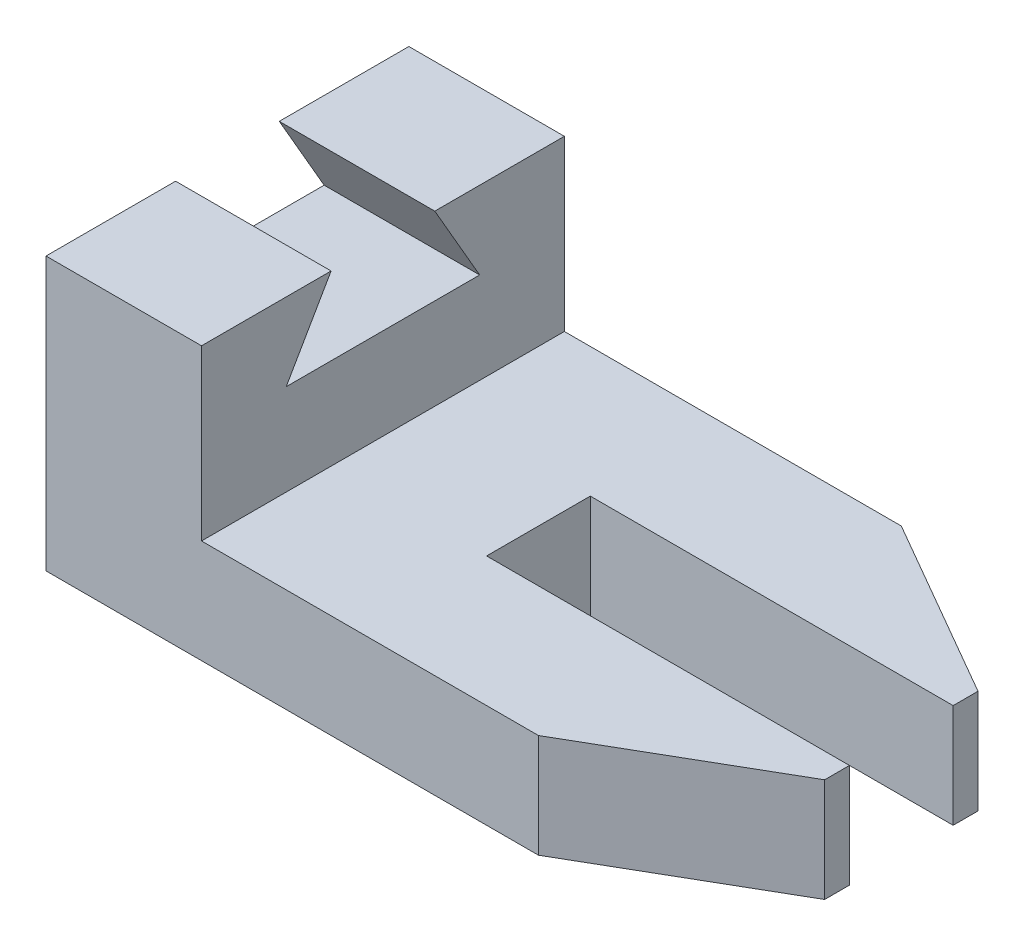
ISO-10303-21;
HEADER;
FILE_DESCRIPTION(('STEP AP214'),'2;1');
FILE_NAME('part.step','',(''),(''),'','','');
FILE_SCHEMA(('AUTOMOTIVE_DESIGN { 1 0 10303 214 1 1 1 1 }'));
ENDSEC;
DATA;
#1=APPLICATION_CONTEXT('core data for automotive mechanical design processes');
#2=APPLICATION_PROTOCOL_DEFINITION('international standard','automotive_design',2000,#1);
#3=PRODUCT_CONTEXT('',#1,'mechanical');
#4=PRODUCT('Part','Part','',(#3));
#5=PRODUCT_RELATED_PRODUCT_CATEGORY('part','',(#4));
#6=PRODUCT_DEFINITION_FORMATION('','',#4);
#7=PRODUCT_DEFINITION_CONTEXT('part definition',#1,'design');
#8=PRODUCT_DEFINITION('design','',#6,#7);
#9=PRODUCT_DEFINITION_SHAPE('','',#8);
#10=(LENGTH_UNIT() NAMED_UNIT(*) SI_UNIT(.MILLI.,.METRE.));
#11=(NAMED_UNIT(*) PLANE_ANGLE_UNIT() SI_UNIT($,.RADIAN.));
#12=(NAMED_UNIT(*) SI_UNIT($,.STERADIAN.) SOLID_ANGLE_UNIT());
#13=UNCERTAINTY_MEASURE_WITH_UNIT(LENGTH_MEASURE(1.E-05),#10,'distance_accuracy_value','');
#14=(GEOMETRIC_REPRESENTATION_CONTEXT(3) GLOBAL_UNCERTAINTY_ASSIGNED_CONTEXT((#13)) GLOBAL_UNIT_ASSIGNED_CONTEXT((#10,
#11,#12)) REPRESENTATION_CONTEXT('',''));
#15=CARTESIAN_POINT('',(0.,0.,0.));
#16=DIRECTION('',(0.,0.,1.));
#17=DIRECTION('',(1.,0.,0.));
#18=AXIS2_PLACEMENT_3D('',#15,#16,#17);
#19=CARTESIAN_POINT('',(0.,20.,0.));
#20=DIRECTION('',(0.,-1.,0.));
#21=DIRECTION('',(0.,0.,-1.));
#22=AXIS2_PLACEMENT_3D('',#19,#20,#21);
#23=PLANE('',#22);
#24=DIRECTION('',(-1.,0.,0.));
#25=VECTOR('',#24,1.);
#26=CARTESIAN_POINT('',(0.,20.,-70.));
#27=LINE('',#26,#25);
#28=CARTESIAN_POINT('',(95.,20.,-70.));
#29=VERTEX_POINT('',#28);
#30=CARTESIAN_POINT('',(30.,20.,-70.));
#31=VERTEX_POINT('',#30);
#32=EDGE_CURVE('E224',#29,#31,#27,.T.);
#33=ORIENTED_EDGE('',*,*,#32,.T.);
#34=DIRECTION('',(0.,0.,1.));
#35=VECTOR('',#34,1.);
#36=CARTESIAN_POINT('',(30.,20.,-35.));
#37=LINE('',#36,#35);
#38=CARTESIAN_POINT('',(30.,20.,0.));
#39=VERTEX_POINT('',#38);
#40=EDGE_CURVE('E50',#31,#39,#37,.T.);
#41=ORIENTED_EDGE('',*,*,#40,.T.);
#42=DIRECTION('',(1.,0.,0.));
#43=VECTOR('',#42,1.);
#44=CARTESIAN_POINT('',(0.,20.,0.));
#45=LINE('',#44,#43);
#46=CARTESIAN_POINT('',(95.,20.,0.));
#47=VERTEX_POINT('',#46);
#48=EDGE_CURVE('E188',#39,#47,#45,.T.);
#49=ORIENTED_EDGE('',*,*,#48,.T.);
#50=DIRECTION('',(0.866025403784438,0.,-0.500000000000001));
#51=VECTOR('',#50,1.);
#52=CARTESIAN_POINT('',(95.,20.,0.));
#53=LINE('',#52,#51);
#54=CARTESIAN_POINT('',(130.,20.,-20.207259421637));
#55=VERTEX_POINT('',#54);
#56=EDGE_CURVE('E210',#47,#55,#53,.T.);
#57=ORIENTED_EDGE('',*,*,#56,.T.);
#58=DIRECTION('',(0.,0.,-1.));
#59=VECTOR('',#58,1.);
#60=CARTESIAN_POINT('',(130.,20.,-20.207259421637));
#61=LINE('',#60,#59);
#62=CARTESIAN_POINT('',(130.,20.,-24.997259421637));
#63=VERTEX_POINT('',#62);
#64=EDGE_CURVE('E212',#55,#63,#61,.T.);
#65=ORIENTED_EDGE('',*,*,#64,.T.);
#66=DIRECTION('',(-1.,0.,0.));
#67=VECTOR('',#66,1.);
#68=CARTESIAN_POINT('',(130.,20.,-24.997259421637));
#69=LINE('',#68,#67);
#70=CARTESIAN_POINT('',(60.,20.,-24.997259421637));
#71=VERTEX_POINT('',#70);
#72=EDGE_CURVE('E214',#63,#71,#69,.T.);
#73=ORIENTED_EDGE('',*,*,#72,.T.);
#74=DIRECTION('',(0.,0.,-1.));
#75=VECTOR('',#74,1.);
#76=CARTESIAN_POINT('',(60.,20.,-24.997259421637));
#77=LINE('',#76,#75);
#78=CARTESIAN_POINT('',(60.,20.,-44.997259421637));
#79=VERTEX_POINT('',#78);
#80=EDGE_CURVE('E216',#71,#79,#77,.T.);
#81=ORIENTED_EDGE('',*,*,#80,.T.);
#82=DIRECTION('',(1.,0.,0.));
#83=VECTOR('',#82,1.);
#84=CARTESIAN_POINT('',(60.,20.,-44.997259421637));
#85=LINE('',#84,#83);
#86=CARTESIAN_POINT('',(130.,20.,-44.997259421637));
#87=VERTEX_POINT('',#86);
#88=EDGE_CURVE('E218',#79,#87,#85,.T.);
#89=ORIENTED_EDGE('',*,*,#88,.T.);
#90=DIRECTION('',(0.,0.,-1.));
#91=VECTOR('',#90,1.);
#92=CARTESIAN_POINT('',(130.,20.,-44.997259421637));
#93=LINE('',#92,#91);
#94=CARTESIAN_POINT('',(130.,20.,-49.792740578363));
#95=VERTEX_POINT('',#94);
#96=EDGE_CURVE('E220',#87,#95,#93,.T.);
#97=ORIENTED_EDGE('',*,*,#96,.T.);
#98=DIRECTION('',(-0.866025403784438,0.,-0.500000000000001));
#99=VECTOR('',#98,1.);
#100=CARTESIAN_POINT('',(95.,20.,-70.));
#101=LINE('',#100,#99);
#102=EDGE_CURVE('E222',#95,#29,#101,.T.);
#103=ORIENTED_EDGE('',*,*,#102,.T.);
#104=EDGE_LOOP('',(#33,#41,#49,#57,#65,#73,#81,#89,#97,#103));
#105=FACE_BOUND('',#104,.T.);
#106=ADVANCED_FACE('F33',(#105),#23,.F.);
#107=CARTESIAN_POINT('',(0.,20.,0.));
#108=DIRECTION('',(1.,0.,0.));
#109=DIRECTION('',(0.,0.,-1.));
#110=AXIS2_PLACEMENT_3D('',#107,#108,#109);
#111=PLANE('',#110);
#112=DIRECTION('',(0.,0.,1.));
#113=VECTOR('',#112,1.);
#114=CARTESIAN_POINT('',(0.,0.,0.));
#115=LINE('',#114,#113);
#116=CARTESIAN_POINT('',(0.,0.,-70.));
#117=VERTEX_POINT('',#116);
#118=CARTESIAN_POINT('',(0.,0.,0.));
#119=VERTEX_POINT('',#118);
#120=EDGE_CURVE('E205',#117,#119,#115,.T.);
#121=ORIENTED_EDGE('',*,*,#120,.T.);
#122=DIRECTION('',(0.,-1.,0.));
#123=VECTOR('',#122,1.);
#124=CARTESIAN_POINT('',(0.,20.,0.));
#125=LINE('',#124,#123);
#126=CARTESIAN_POINT('',(0.,52.6091602691578,0.));
#127=VERTEX_POINT('',#126);
#128=EDGE_CURVE('E11',#127,#119,#125,.T.);
#129=ORIENTED_EDGE('',*,*,#128,.F.);
#130=DIRECTION('',(0.,0.,-1.));
#131=VECTOR('',#130,1.);
#132=CARTESIAN_POINT('',(0.,52.6091602691578,0.));
#133=LINE('',#132,#131);
#134=CARTESIAN_POINT('',(0.,52.6091602691574,-25.0000000000007));
#135=VERTEX_POINT('',#134);
#136=EDGE_CURVE('E197',#127,#135,#133,.T.);
#137=ORIENTED_EDGE('',*,*,#136,.T.);
#138=DIRECTION('',(0.,-0.866025403784436,0.500000000000004));
#139=VECTOR('',#138,1.);
#140=CARTESIAN_POINT('',(0.,52.6091602691574,-25.0000000000007));
#141=LINE('',#140,#139);
#142=CARTESIAN_POINT('',(0.,37.6091602691574,-16.3397459621562));
#143=VERTEX_POINT('',#142);
#144=EDGE_CURVE('E200',#135,#143,#141,.T.);
#145=ORIENTED_EDGE('',*,*,#144,.T.);
#146=DIRECTION('',(0.,0.,-1.));
#147=VECTOR('',#146,1.);
#148=CARTESIAN_POINT('',(0.,37.6091602691574,-16.3397459621562));
#149=LINE('',#148,#147);
#150=CARTESIAN_POINT('',(0.,37.6091602691574,-53.6602540378438));
#151=VERTEX_POINT('',#150);
#152=EDGE_CURVE('E187',#143,#151,#149,.T.);
#153=ORIENTED_EDGE('',*,*,#152,.T.);
#154=DIRECTION('',(0.,-0.866025403784436,-0.500000000000004));
#155=VECTOR('',#154,1.);
#156=CARTESIAN_POINT('',(0.,52.6091602691574,-44.9999999999993));
#157=LINE('',#156,#155);
#158=CARTESIAN_POINT('',(0.,52.6091602691574,-44.9999999999993));
#159=VERTEX_POINT('',#158);
#160=EDGE_CURVE('E172',#159,#151,#157,.T.);
#161=ORIENTED_EDGE('',*,*,#160,.F.);
#162=DIRECTION('',(0.,0.,1.));
#163=VECTOR('',#162,1.);
#164=CARTESIAN_POINT('',(0.,52.6091602691578,-70.));
#165=LINE('',#164,#163);
#166=CARTESIAN_POINT('',(0.,52.6091602691578,-70.));
#167=VERTEX_POINT('',#166);
#168=EDGE_CURVE('E167',#167,#159,#165,.T.);
#169=ORIENTED_EDGE('',*,*,#168,.F.);
#170=DIRECTION('',(0.,-1.,0.));
#171=VECTOR('',#170,1.);
#172=CARTESIAN_POINT('',(0.,20.,-70.));
#173=LINE('',#172,#171);
#174=EDGE_CURVE('E226',#167,#117,#173,.T.);
#175=ORIENTED_EDGE('',*,*,#174,.T.);
#176=EDGE_LOOP('',(#121,#129,#137,#145,#153,#161,#169,#175));
#177=FACE_BOUND('',#176,.T.);
#178=ADVANCED_FACE('F35',(#177),#111,.F.);
#179=CARTESIAN_POINT('',(0.,20.,0.));
#180=DIRECTION('',(0.,0.,-1.));
#181=DIRECTION('',(-1.,0.,0.));
#182=AXIS2_PLACEMENT_3D('',#179,#180,#181);
#183=PLANE('',#182);
#184=DIRECTION('',(1.,0.,0.));
#185=VECTOR('',#184,1.);
#186=CARTESIAN_POINT('',(0.,0.,0.));
#187=LINE('',#186,#185);
#188=CARTESIAN_POINT('',(95.,0.,0.));
#189=VERTEX_POINT('',#188);
#190=EDGE_CURVE('E229',#119,#189,#187,.T.);
#191=ORIENTED_EDGE('',*,*,#190,.T.);
#192=DIRECTION('',(0.,-1.,0.));
#193=VECTOR('',#192,1.);
#194=CARTESIAN_POINT('',(95.,20.,0.));
#195=LINE('',#194,#193);
#196=EDGE_CURVE('E42',#47,#189,#195,.T.);
#197=ORIENTED_EDGE('',*,*,#196,.F.);
#198=ORIENTED_EDGE('',*,*,#48,.F.);
#199=DIRECTION('',(0.,1.,0.));
#200=VECTOR('',#199,1.);
#201=CARTESIAN_POINT('',(30.,20.,0.));
#202=LINE('',#201,#200);
#203=CARTESIAN_POINT('',(30.,52.6091602691578,0.));
#204=VERTEX_POINT('',#203);
#205=EDGE_CURVE('E55',#39,#204,#202,.T.);
#206=ORIENTED_EDGE('',*,*,#205,.T.);
#207=DIRECTION('',(-1.,0.,0.));
#208=VECTOR('',#207,1.);
#209=CARTESIAN_POINT('',(30.,52.6091602691578,0.));
#210=LINE('',#209,#208);
#211=EDGE_CURVE('E156',#204,#127,#210,.T.);
#212=ORIENTED_EDGE('',*,*,#211,.T.);
#213=ORIENTED_EDGE('',*,*,#128,.T.);
#214=EDGE_LOOP('',(#191,#197,#198,#206,#212,#213));
#215=FACE_BOUND('',#214,.T.);
#216=ADVANCED_FACE('F294',(#215),#183,.F.);
#217=CARTESIAN_POINT('',(95.,20.,0.));
#218=DIRECTION('',(-0.500000000000001,0.,-0.866025403784438));
#219=DIRECTION('',(-0.866025403784438,0.,0.500000000000001));
#220=AXIS2_PLACEMENT_3D('',#217,#218,#219);
#221=PLANE('',#220);
#222=DIRECTION('',(0.866025403784438,0.,-0.500000000000001));
#223=VECTOR('',#222,1.);
#224=CARTESIAN_POINT('',(95.,0.,0.));
#225=LINE('',#224,#223);
#226=CARTESIAN_POINT('',(130.,0.,-20.207259421637));
#227=VERTEX_POINT('',#226);
#228=EDGE_CURVE('E231',#189,#227,#225,.T.);
#229=ORIENTED_EDGE('',*,*,#228,.T.);
#230=DIRECTION('',(0.,-1.,0.));
#231=VECTOR('',#230,1.);
#232=CARTESIAN_POINT('',(130.,20.,-20.207259421637));
#233=LINE('',#232,#231);
#234=EDGE_CURVE('E267',#55,#227,#233,.T.);
#235=ORIENTED_EDGE('',*,*,#234,.F.);
#236=ORIENTED_EDGE('',*,*,#56,.F.);
#237=ORIENTED_EDGE('',*,*,#196,.T.);
#238=EDGE_LOOP('',(#229,#235,#236,#237));
#239=FACE_BOUND('',#238,.T.);
#240=ADVANCED_FACE('F275',(#239),#221,.F.);
#241=CARTESIAN_POINT('',(130.,20.,-20.207259421637));
#242=DIRECTION('',(-1.,0.,0.));
#243=DIRECTION('',(0.,0.,1.));
#244=AXIS2_PLACEMENT_3D('',#241,#242,#243);
#245=PLANE('',#244);
#246=DIRECTION('',(0.,0.,-1.));
#247=VECTOR('',#246,1.);
#248=CARTESIAN_POINT('',(130.,0.,-20.207259421637));
#249=LINE('',#248,#247);
#250=CARTESIAN_POINT('',(130.,0.,-24.997259421637));
#251=VERTEX_POINT('',#250);
#252=EDGE_CURVE('E233',#227,#251,#249,.T.);
#253=ORIENTED_EDGE('',*,*,#252,.T.);
#254=DIRECTION('',(0.,-1.,0.));
#255=VECTOR('',#254,1.);
#256=CARTESIAN_POINT('',(130.,20.,-24.997259421637));
#257=LINE('',#256,#255);
#258=EDGE_CURVE('E264',#63,#251,#257,.T.);
#259=ORIENTED_EDGE('',*,*,#258,.F.);
#260=ORIENTED_EDGE('',*,*,#64,.F.);
#261=ORIENTED_EDGE('',*,*,#234,.T.);
#262=EDGE_LOOP('',(#253,#259,#260,#261));
#263=FACE_BOUND('',#262,.T.);
#264=ADVANCED_FACE('F285',(#263),#245,.F.);
#265=CARTESIAN_POINT('',(130.,20.,-24.997259421637));
#266=DIRECTION('',(0.,0.,1.));
#267=DIRECTION('',(1.,0.,0.));
#268=AXIS2_PLACEMENT_3D('',#265,#266,#267);
#269=PLANE('',#268);
#270=DIRECTION('',(-1.,0.,0.));
#271=VECTOR('',#270,1.);
#272=CARTESIAN_POINT('',(130.,0.,-24.997259421637));
#273=LINE('',#272,#271);
#274=CARTESIAN_POINT('',(60.,0.,-24.997259421637));
#275=VERTEX_POINT('',#274);
#276=EDGE_CURVE('E235',#251,#275,#273,.T.);
#277=ORIENTED_EDGE('',*,*,#276,.T.);
#278=DIRECTION('',(0.,-1.,0.));
#279=VECTOR('',#278,1.);
#280=CARTESIAN_POINT('',(60.,20.,-24.997259421637));
#281=LINE('',#280,#279);
#282=EDGE_CURVE('E261',#71,#275,#281,.T.);
#283=ORIENTED_EDGE('',*,*,#282,.F.);
#284=ORIENTED_EDGE('',*,*,#72,.F.);
#285=ORIENTED_EDGE('',*,*,#258,.T.);
#286=EDGE_LOOP('',(#277,#283,#284,#285));
#287=FACE_BOUND('',#286,.T.);
#288=ADVANCED_FACE('F289',(#287),#269,.F.);
#289=CARTESIAN_POINT('',(60.,20.,-24.997259421637));
#290=DIRECTION('',(-1.,0.,0.));
#291=DIRECTION('',(0.,0.,1.));
#292=AXIS2_PLACEMENT_3D('',#289,#290,#291);
#293=PLANE('',#292);
#294=DIRECTION('',(0.,0.,-1.));
#295=VECTOR('',#294,1.);
#296=CARTESIAN_POINT('',(60.,0.,-24.997259421637));
#297=LINE('',#296,#295);
#298=CARTESIAN_POINT('',(60.,0.,-44.997259421637));
#299=VERTEX_POINT('',#298);
#300=EDGE_CURVE('E237',#275,#299,#297,.T.);
#301=ORIENTED_EDGE('',*,*,#300,.T.);
#302=DIRECTION('',(0.,-1.,0.));
#303=VECTOR('',#302,1.);
#304=CARTESIAN_POINT('',(60.,20.,-44.997259421637));
#305=LINE('',#304,#303);
#306=EDGE_CURVE('E258',#79,#299,#305,.T.);
#307=ORIENTED_EDGE('',*,*,#306,.F.);
#308=ORIENTED_EDGE('',*,*,#80,.F.);
#309=ORIENTED_EDGE('',*,*,#282,.T.);
#310=EDGE_LOOP('',(#301,#307,#308,#309));
#311=FACE_BOUND('',#310,.T.);
#312=ADVANCED_FACE('F327',(#311),#293,.F.);
#313=CARTESIAN_POINT('',(60.,20.,-44.997259421637));
#314=DIRECTION('',(0.,0.,-1.));
#315=DIRECTION('',(-1.,0.,0.));
#316=AXIS2_PLACEMENT_3D('',#313,#314,#315);
#317=PLANE('',#316);
#318=DIRECTION('',(1.,0.,0.));
#319=VECTOR('',#318,1.);
#320=CARTESIAN_POINT('',(60.,0.,-44.997259421637));
#321=LINE('',#320,#319);
#322=CARTESIAN_POINT('',(130.,0.,-44.997259421637));
#323=VERTEX_POINT('',#322);
#324=EDGE_CURVE('E239',#299,#323,#321,.T.);
#325=ORIENTED_EDGE('',*,*,#324,.T.);
#326=DIRECTION('',(0.,-1.,0.));
#327=VECTOR('',#326,1.);
#328=CARTESIAN_POINT('',(130.,20.,-44.997259421637));
#329=LINE('',#328,#327);
#330=EDGE_CURVE('E255',#87,#323,#329,.T.);
#331=ORIENTED_EDGE('',*,*,#330,.F.);
#332=ORIENTED_EDGE('',*,*,#88,.F.);
#333=ORIENTED_EDGE('',*,*,#306,.T.);
#334=EDGE_LOOP('',(#325,#331,#332,#333));
#335=FACE_BOUND('',#334,.T.);
#336=ADVANCED_FACE('F323',(#335),#317,.F.);
#337=CARTESIAN_POINT('',(130.,20.,-44.997259421637));
#338=DIRECTION('',(-1.,0.,0.));
#339=DIRECTION('',(0.,0.,1.));
#340=AXIS2_PLACEMENT_3D('',#337,#338,#339);
#341=PLANE('',#340);
#342=DIRECTION('',(0.,0.,-1.));
#343=VECTOR('',#342,1.);
#344=CARTESIAN_POINT('',(130.,0.,-44.997259421637));
#345=LINE('',#344,#343);
#346=CARTESIAN_POINT('',(130.,0.,-49.792740578363));
#347=VERTEX_POINT('',#346);
#348=EDGE_CURVE('E241',#323,#347,#345,.T.);
#349=ORIENTED_EDGE('',*,*,#348,.T.);
#350=DIRECTION('',(0.,-1.,0.));
#351=VECTOR('',#350,1.);
#352=CARTESIAN_POINT('',(130.,20.,-49.792740578363));
#353=LINE('',#352,#351);
#354=EDGE_CURVE('E252',#95,#347,#353,.T.);
#355=ORIENTED_EDGE('',*,*,#354,.F.);
#356=ORIENTED_EDGE('',*,*,#96,.F.);
#357=ORIENTED_EDGE('',*,*,#330,.T.);
#358=EDGE_LOOP('',(#349,#355,#356,#357));
#359=FACE_BOUND('',#358,.T.);
#360=ADVANCED_FACE('F319',(#359),#341,.F.);
#361=CARTESIAN_POINT('',(95.,20.,-70.));
#362=DIRECTION('',(-0.500000000000001,0.,0.866025403784438));
#363=DIRECTION('',(0.866025403784438,0.,0.500000000000001));
#364=AXIS2_PLACEMENT_3D('',#361,#362,#363);
#365=PLANE('',#364);
#366=DIRECTION('',(-0.866025403784438,0.,-0.500000000000001));
#367=VECTOR('',#366,1.);
#368=CARTESIAN_POINT('',(95.,0.,-70.));
#369=LINE('',#368,#367);
#370=CARTESIAN_POINT('',(95.,0.,-70.));
#371=VERTEX_POINT('',#370);
#372=EDGE_CURVE('E243',#347,#371,#369,.T.);
#373=ORIENTED_EDGE('',*,*,#372,.T.);
#374=DIRECTION('',(0.,-1.,0.));
#375=VECTOR('',#374,1.);
#376=CARTESIAN_POINT('',(95.,20.,-70.));
#377=LINE('',#376,#375);
#378=EDGE_CURVE('E249',#29,#371,#377,.T.);
#379=ORIENTED_EDGE('',*,*,#378,.F.);
#380=ORIENTED_EDGE('',*,*,#102,.F.);
#381=ORIENTED_EDGE('',*,*,#354,.T.);
#382=EDGE_LOOP('',(#373,#379,#380,#381));
#383=FACE_BOUND('',#382,.T.);
#384=ADVANCED_FACE('F315',(#383),#365,.F.);
#385=CARTESIAN_POINT('',(0.,20.,-70.));
#386=DIRECTION('',(0.,0.,1.));
#387=DIRECTION('',(1.,0.,0.));
#388=AXIS2_PLACEMENT_3D('',#385,#386,#387);
#389=PLANE('',#388);
#390=DIRECTION('',(-1.,0.,0.));
#391=VECTOR('',#390,1.);
#392=CARTESIAN_POINT('',(0.,0.,-70.));
#393=LINE('',#392,#391);
#394=EDGE_CURVE('E245',#371,#117,#393,.T.);
#395=ORIENTED_EDGE('',*,*,#394,.T.);
#396=ORIENTED_EDGE('',*,*,#174,.F.);
#397=DIRECTION('',(-1.,0.,0.));
#398=VECTOR('',#397,1.);
#399=CARTESIAN_POINT('',(30.,52.6091602691578,-70.));
#400=LINE('',#399,#398);
#401=CARTESIAN_POINT('',(30.,52.6091602691578,-70.));
#402=VERTEX_POINT('',#401);
#403=EDGE_CURVE('E176',#402,#167,#400,.T.);
#404=ORIENTED_EDGE('',*,*,#403,.F.);
#405=DIRECTION('',(0.,1.,0.));
#406=VECTOR('',#405,1.);
#407=CARTESIAN_POINT('',(30.,20.,-70.));
#408=LINE('',#407,#406);
#409=EDGE_CURVE('E174',#31,#402,#408,.T.);
#410=ORIENTED_EDGE('',*,*,#409,.F.);
#411=ORIENTED_EDGE('',*,*,#32,.F.);
#412=ORIENTED_EDGE('',*,*,#378,.T.);
#413=EDGE_LOOP('',(#395,#396,#404,#410,#411,#412));
#414=FACE_BOUND('',#413,.T.);
#415=ADVANCED_FACE('F312',(#414),#389,.F.);
#416=CARTESIAN_POINT('',(0.,0.,0.));
#417=DIRECTION('',(0.,-1.,0.));
#418=DIRECTION('',(0.,0.,-1.));
#419=AXIS2_PLACEMENT_3D('',#416,#417,#418);
#420=PLANE('',#419);
#421=ORIENTED_EDGE('',*,*,#120,.F.);
#422=ORIENTED_EDGE('',*,*,#394,.F.);
#423=ORIENTED_EDGE('',*,*,#372,.F.);
#424=ORIENTED_EDGE('',*,*,#348,.F.);
#425=ORIENTED_EDGE('',*,*,#324,.F.);
#426=ORIENTED_EDGE('',*,*,#300,.F.);
#427=ORIENTED_EDGE('',*,*,#276,.F.);
#428=ORIENTED_EDGE('',*,*,#252,.F.);
#429=ORIENTED_EDGE('',*,*,#228,.F.);
#430=ORIENTED_EDGE('',*,*,#190,.F.);
#431=EDGE_LOOP('',(#421,#422,#423,#424,#425,#426,#427,#428,#429,#430));
#432=FACE_BOUND('',#431,.T.);
#433=ADVANCED_FACE('F280',(#432),#420,.T.);
#434=CARTESIAN_POINT('',(30.,37.6091602691574,-16.3397459621562));
#435=DIRECTION('',(0.,1.,0.));
#436=DIRECTION('',(0.,0.,1.));
#437=AXIS2_PLACEMENT_3D('',#434,#435,#436);
#438=PLANE('',#437);
#439=ORIENTED_EDGE('',*,*,#152,.F.);
#440=DIRECTION('',(-1.,0.,0.));
#441=VECTOR('',#440,1.);
#442=CARTESIAN_POINT('',(30.,37.6091602691574,-16.3397459621562));
#443=LINE('',#442,#441);
#444=CARTESIAN_POINT('',(30.,37.6091602691574,-16.3397459621562));
#445=VERTEX_POINT('',#444);
#446=EDGE_CURVE('E153',#445,#143,#443,.T.);
#447=ORIENTED_EDGE('',*,*,#446,.F.);
#448=DIRECTION('',(0.,0.,-1.));
#449=VECTOR('',#448,1.);
#450=CARTESIAN_POINT('',(30.,37.6091602691574,-16.3397459621562));
#451=LINE('',#450,#449);
#452=CARTESIAN_POINT('',(30.,37.6091602691574,-53.6602540378438));
#453=VERTEX_POINT('',#452);
#454=EDGE_CURVE('E147',#445,#453,#451,.T.);
#455=ORIENTED_EDGE('',*,*,#454,.T.);
#456=DIRECTION('',(-1.,0.,0.));
#457=VECTOR('',#456,1.);
#458=CARTESIAN_POINT('',(30.,37.6091602691574,-53.6602540378438));
#459=LINE('',#458,#457);
#460=EDGE_CURVE('E152',#453,#151,#459,.T.);
#461=ORIENTED_EDGE('',*,*,#460,.T.);
#462=EDGE_LOOP('',(#439,#447,#455,#461));
#463=FACE_BOUND('',#462,.T.);
#464=ADVANCED_FACE('F150',(#463),#438,.T.);
#465=CARTESIAN_POINT('',(30.,52.6091602691574,-25.0000000000007));
#466=DIRECTION('',(0.,-0.500000000000004,-0.866025403784436));
#467=DIRECTION('',(0.,0.866025403784436,-0.500000000000004));
#468=AXIS2_PLACEMENT_3D('',#465,#466,#467);
#469=PLANE('',#468);
#470=ORIENTED_EDGE('',*,*,#144,.F.);
#471=DIRECTION('',(-1.,0.,0.));
#472=VECTOR('',#471,1.);
#473=CARTESIAN_POINT('',(30.,52.6091602691574,-25.0000000000007));
#474=LINE('',#473,#472);
#475=CARTESIAN_POINT('',(30.,52.6091602691574,-25.0000000000007));
#476=VERTEX_POINT('',#475);
#477=EDGE_CURVE('E206',#476,#135,#474,.T.);
#478=ORIENTED_EDGE('',*,*,#477,.F.);
#479=DIRECTION('',(0.,-0.866025403784436,0.500000000000004));
#480=VECTOR('',#479,1.);
#481=CARTESIAN_POINT('',(30.,52.6091602691574,-25.0000000000007));
#482=LINE('',#481,#480);
#483=EDGE_CURVE('E157',#476,#445,#482,.T.);
#484=ORIENTED_EDGE('',*,*,#483,.T.);
#485=ORIENTED_EDGE('',*,*,#446,.T.);
#486=EDGE_LOOP('',(#470,#478,#484,#485));
#487=FACE_BOUND('',#486,.T.);
#488=ADVANCED_FACE('F374',(#487),#469,.T.);
#489=CARTESIAN_POINT('',(30.,52.6091602691578,0.));
#490=DIRECTION('',(0.,1.,0.));
#491=DIRECTION('',(0.,0.,1.));
#492=AXIS2_PLACEMENT_3D('',#489,#490,#491);
#493=PLANE('',#492);
#494=ORIENTED_EDGE('',*,*,#136,.F.);
#495=ORIENTED_EDGE('',*,*,#211,.F.);
#496=DIRECTION('',(0.,0.,-1.));
#497=VECTOR('',#496,1.);
#498=CARTESIAN_POINT('',(30.,52.6091602691578,0.));
#499=LINE('',#498,#497);
#500=EDGE_CURVE('E183',#204,#476,#499,.T.);
#501=ORIENTED_EDGE('',*,*,#500,.T.);
#502=ORIENTED_EDGE('',*,*,#477,.T.);
#503=EDGE_LOOP('',(#494,#495,#501,#502));
#504=FACE_BOUND('',#503,.T.);
#505=ADVANCED_FACE('F308',(#504),#493,.T.);
#506=CARTESIAN_POINT('',(30.,0.,0.));
#507=DIRECTION('',(-1.,0.,0.));
#508=DIRECTION('',(0.,0.,1.));
#509=AXIS2_PLACEMENT_3D('',#506,#507,#508);
#510=PLANE('',#509);
#511=ORIENTED_EDGE('',*,*,#40,.F.);
#512=ORIENTED_EDGE('',*,*,#409,.T.);
#513=DIRECTION('',(0.,0.,1.));
#514=VECTOR('',#513,1.);
#515=CARTESIAN_POINT('',(30.,52.6091602691578,-70.));
#516=LINE('',#515,#514);
#517=CARTESIAN_POINT('',(30.,52.6091602691574,-44.9999999999993));
#518=VERTEX_POINT('',#517);
#519=EDGE_CURVE('E163',#402,#518,#516,.T.);
#520=ORIENTED_EDGE('',*,*,#519,.T.);
#521=DIRECTION('',(0.,-0.866025403784436,-0.500000000000004));
#522=VECTOR('',#521,1.);
#523=CARTESIAN_POINT('',(30.,52.6091602691574,-44.9999999999993));
#524=LINE('',#523,#522);
#525=EDGE_CURVE('E160',#518,#453,#524,.T.);
#526=ORIENTED_EDGE('',*,*,#525,.T.);
#527=ORIENTED_EDGE('',*,*,#454,.F.);
#528=ORIENTED_EDGE('',*,*,#483,.F.);
#529=ORIENTED_EDGE('',*,*,#500,.F.);
#530=ORIENTED_EDGE('',*,*,#205,.F.);
#531=EDGE_LOOP('',(#511,#512,#520,#526,#527,#528,#529,#530));
#532=FACE_BOUND('',#531,.T.);
#533=ADVANCED_FACE('F161',(#532),#510,.F.);
#534=CARTESIAN_POINT('',(30.,52.6091602691578,-70.));
#535=DIRECTION('',(0.,-1.,0.));
#536=DIRECTION('',(0.,0.,-1.));
#537=AXIS2_PLACEMENT_3D('',#534,#535,#536);
#538=PLANE('',#537);
#539=ORIENTED_EDGE('',*,*,#168,.T.);
#540=DIRECTION('',(-1.,0.,0.));
#541=VECTOR('',#540,1.);
#542=CARTESIAN_POINT('',(30.,52.6091602691574,-44.9999999999993));
#543=LINE('',#542,#541);
#544=EDGE_CURVE('E173',#518,#159,#543,.T.);
#545=ORIENTED_EDGE('',*,*,#544,.F.);
#546=ORIENTED_EDGE('',*,*,#519,.F.);
#547=ORIENTED_EDGE('',*,*,#403,.T.);
#548=EDGE_LOOP('',(#539,#545,#546,#547));
#549=FACE_BOUND('',#548,.T.);
#550=ADVANCED_FACE('F391',(#549),#538,.F.);
#551=CARTESIAN_POINT('',(30.,52.6091602691574,-44.9999999999993));
#552=DIRECTION('',(0.,0.500000000000004,-0.866025403784436));
#553=DIRECTION('',(0.,0.866025403784436,0.500000000000004));
#554=AXIS2_PLACEMENT_3D('',#551,#552,#553);
#555=PLANE('',#554);
#556=ORIENTED_EDGE('',*,*,#160,.T.);
#557=ORIENTED_EDGE('',*,*,#460,.F.);
#558=ORIENTED_EDGE('',*,*,#525,.F.);
#559=ORIENTED_EDGE('',*,*,#544,.T.);
#560=EDGE_LOOP('',(#556,#557,#558,#559));
#561=FACE_BOUND('',#560,.T.);
#562=ADVANCED_FACE('F170',(#561),#555,.F.);
#563=CLOSED_SHELL('',(#106,#178,#216,#240,#264,#288,#312,#336,#360,#384,#415,#433,#464,#488,
#505,#533,#550,#562));
#564=MANIFOLD_SOLID_BREP('B2',#563);
#565=ADVANCED_BREP_SHAPE_REPRESENTATION('',(#18,#564),#14);
#566=SHAPE_DEFINITION_REPRESENTATION(#9,#565);
ENDSEC;
END-ISO-10303-21;
